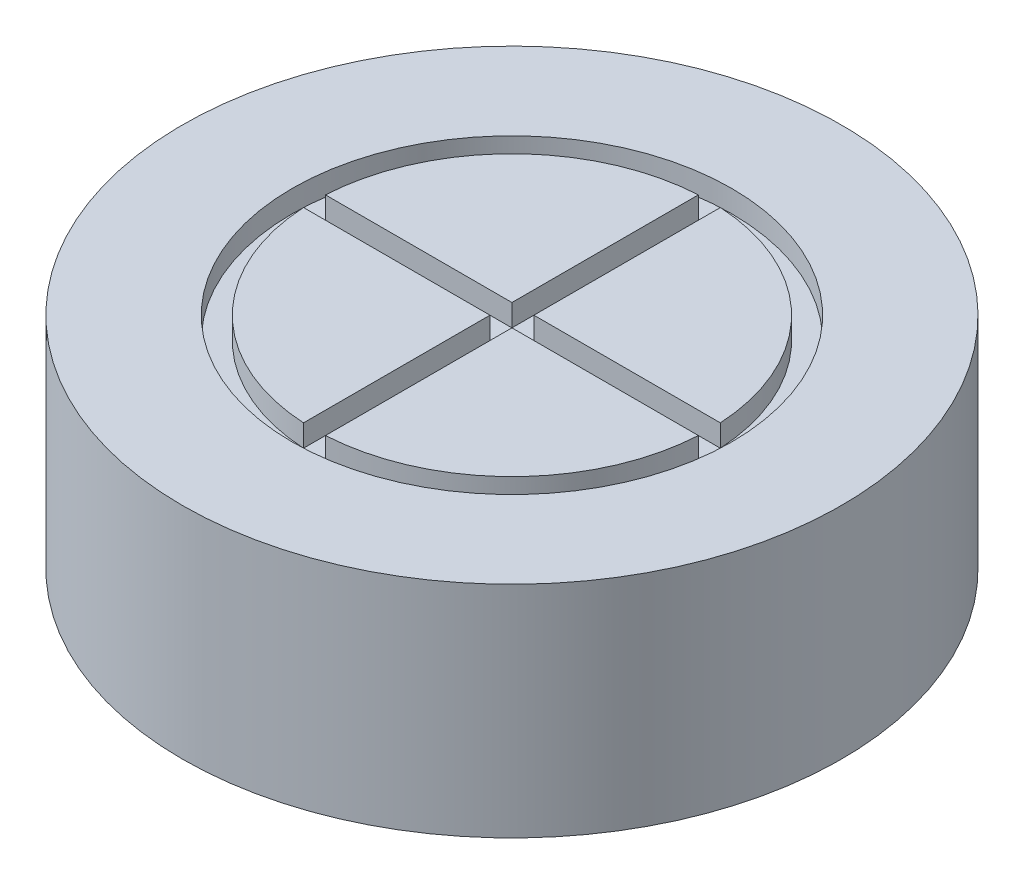
ISO-10303-21;
HEADER;
FILE_DESCRIPTION(('STEP AP214'),'2;1');
FILE_NAME('part.step','',(''),(''),'','','');
FILE_SCHEMA(('AUTOMOTIVE_DESIGN { 1 0 10303 214 1 1 1 1 }'));
ENDSEC;
DATA;
#1=APPLICATION_CONTEXT('core data for automotive mechanical design processes');
#2=APPLICATION_PROTOCOL_DEFINITION('international standard','automotive_design',2000,#1);
#3=PRODUCT_CONTEXT('',#1,'mechanical');
#4=PRODUCT('Part','Part','',(#3));
#5=PRODUCT_RELATED_PRODUCT_CATEGORY('part','',(#4));
#6=PRODUCT_DEFINITION_FORMATION('','',#4);
#7=PRODUCT_DEFINITION_CONTEXT('part definition',#1,'design');
#8=PRODUCT_DEFINITION('design','',#6,#7);
#9=PRODUCT_DEFINITION_SHAPE('','',#8);
#10=(LENGTH_UNIT() NAMED_UNIT(*) SI_UNIT(.MILLI.,.METRE.));
#11=(NAMED_UNIT(*) PLANE_ANGLE_UNIT() SI_UNIT($,.RADIAN.));
#12=(NAMED_UNIT(*) SI_UNIT($,.STERADIAN.) SOLID_ANGLE_UNIT());
#13=UNCERTAINTY_MEASURE_WITH_UNIT(LENGTH_MEASURE(1.E-05),#10,'distance_accuracy_value','');
#14=(GEOMETRIC_REPRESENTATION_CONTEXT(3) GLOBAL_UNCERTAINTY_ASSIGNED_CONTEXT((#13)) GLOBAL_UNIT_ASSIGNED_CONTEXT((#10,
#11,#12)) REPRESENTATION_CONTEXT('',''));
#15=CARTESIAN_POINT('',(0.,0.,0.));
#16=DIRECTION('',(0.,0.,1.));
#17=DIRECTION('',(1.,0.,0.));
#18=AXIS2_PLACEMENT_3D('',#15,#16,#17);
#19=CARTESIAN_POINT('',(0.,0.,0.));
#20=DIRECTION('',(0.,1.,0.));
#21=DIRECTION('',(0.,0.,1.));
#22=AXIS2_PLACEMENT_3D('',#19,#20,#21);
#23=PLANE('',#22);
#24=CARTESIAN_POINT('',(0.,0.,0.));
#25=DIRECTION('',(0.,1.,0.));
#26=DIRECTION('',(0.,0.,1.));
#27=AXIS2_PLACEMENT_3D('',#24,#25,#26);
#28=CIRCLE('',#27,15.);
#29=CARTESIAN_POINT('',(0.,0.,15.));
#30=VERTEX_POINT('',#29);
#31=EDGE_CURVE('E42',#30,#30,#28,.T.);
#32=ORIENTED_EDGE('',*,*,#31,.F.);
#33=EDGE_LOOP('',(#32));
#34=FACE_BOUND('',#33,.T.);
#35=CARTESIAN_POINT('',(0.,0.,0.));
#36=DIRECTION('',(0.,1.,0.));
#37=DIRECTION('',(0.,0.,1.));
#38=AXIS2_PLACEMENT_3D('',#35,#36,#37);
#39=CIRCLE('',#38,5.);
#40=CARTESIAN_POINT('',(0.,0.,5.));
#41=VERTEX_POINT('',#40);
#42=EDGE_CURVE('E37',#41,#41,#39,.F.);
#43=ORIENTED_EDGE('',*,*,#42,.F.);
#44=EDGE_LOOP('',(#43));
#45=FACE_BOUND('',#44,.T.);
#46=ADVANCED_FACE('F33',(#34,#45),#23,.F.);
#47=CARTESIAN_POINT('',(0.,10.,0.));
#48=DIRECTION('',(0.,-1.,0.));
#49=DIRECTION('',(0.,0.,-1.));
#50=AXIS2_PLACEMENT_3D('',#47,#48,#49);
#51=CYLINDRICAL_SURFACE('',#50,15.);
#52=CARTESIAN_POINT('',(0.,10.,0.));
#53=DIRECTION('',(0.,1.,0.));
#54=DIRECTION('',(0.,0.,1.));
#55=AXIS2_PLACEMENT_3D('',#52,#53,#54);
#56=CIRCLE('',#55,15.);
#57=CARTESIAN_POINT('',(0.,10.,15.));
#58=VERTEX_POINT('',#57);
#59=EDGE_CURVE('E11',#58,#58,#56,.T.);
#60=ORIENTED_EDGE('',*,*,#59,.F.);
#61=EDGE_LOOP('',(#60));
#62=FACE_BOUND('',#61,.T.);
#63=ORIENTED_EDGE('',*,*,#31,.T.);
#64=EDGE_LOOP('',(#63));
#65=FACE_BOUND('',#64,.T.);
#66=ADVANCED_FACE('F35',(#62,#65),#51,.T.);
#67=CARTESIAN_POINT('',(0.,10.,0.));
#68=DIRECTION('',(0.,1.,0.));
#69=DIRECTION('',(0.,0.,1.));
#70=AXIS2_PLACEMENT_3D('',#67,#68,#69);
#71=PLANE('',#70);
#72=CARTESIAN_POINT('',(0.,10.,0.));
#73=DIRECTION('',(0.,1.,0.));
#74=DIRECTION('',(0.,0.,1.));
#75=AXIS2_PLACEMENT_3D('',#72,#73,#74);
#76=CIRCLE('',#75,10.);
#77=CARTESIAN_POINT('',(0.,10.,10.));
#78=VERTEX_POINT('',#77);
#79=EDGE_CURVE('E227',#78,#78,#76,.T.);
#80=ORIENTED_EDGE('',*,*,#79,.F.);
#81=EDGE_LOOP('',(#80));
#82=FACE_BOUND('',#81,.T.);
#83=ORIENTED_EDGE('',*,*,#59,.T.);
#84=EDGE_LOOP('',(#83));
#85=FACE_BOUND('',#84,.T.);
#86=ADVANCED_FACE('F248',(#82,#85),#71,.T.);
#87=CARTESIAN_POINT('',(0.,0.,0.));
#88=DIRECTION('',(0.,0.,-1.));
#89=DIRECTION('',(-1.,0.,0.));
#90=AXIS2_PLACEMENT_3D('',#87,#88,#89);
#91=SPHERICAL_SURFACE('',#90,5.);
#92=CARTESIAN_POINT('',(0.,0.,0.));
#93=DIRECTION('',(0.,1.,0.));
#94=DIRECTION('',(0.,0.,1.));
#95=AXIS2_PLACEMENT_3D('',#92,#93,#94);
#96=SPHERICAL_SURFACE('',#95,5.);
#97=ORIENTED_EDGE('',*,*,#42,.T.);
#98=EDGE_LOOP('',(#97));
#99=FACE_BOUND('',#98,.T.);
#100=ADVANCED_FACE('F241',(#99),#96,.F.);
#101=CARTESIAN_POINT('',(0.,9.,0.));
#102=DIRECTION('',(0.,1.,0.));
#103=DIRECTION('',(0.,0.,1.));
#104=AXIS2_PLACEMENT_3D('',#101,#102,#103);
#105=CYLINDRICAL_SURFACE('',#104,10.);
#106=CARTESIAN_POINT('',(0.,9.,0.));
#107=DIRECTION('',(0.,1.,0.));
#108=DIRECTION('',(0.,0.,1.));
#109=AXIS2_PLACEMENT_3D('',#106,#107,#108);
#110=CIRCLE('',#109,10.);
#111=CARTESIAN_POINT('',(0.,9.,10.));
#112=VERTEX_POINT('',#111);
#113=EDGE_CURVE('E231',#112,#112,#110,.T.);
#114=ORIENTED_EDGE('',*,*,#113,.F.);
#115=EDGE_LOOP('',(#114));
#116=FACE_BOUND('',#115,.T.);
#117=ORIENTED_EDGE('',*,*,#79,.T.);
#118=EDGE_LOOP('',(#117));
#119=FACE_BOUND('',#118,.T.);
#120=ADVANCED_FACE('F258',(#116,#119),#105,.F.);
#121=CARTESIAN_POINT('',(0.,9.,0.));
#122=DIRECTION('',(0.,1.,0.));
#123=DIRECTION('',(0.,0.,1.));
#124=AXIS2_PLACEMENT_3D('',#121,#122,#123);
#125=PLANE('',#124);
#126=DIRECTION('',(0.,0.,1.));
#127=VECTOR('',#126,1.);
#128=CARTESIAN_POINT('',(0.499807061540183,9.,-8.98611111111111));
#129=LINE('',#128,#127);
#130=CARTESIAN_POINT('',(0.499807061540183,9.,-8.98611111111111));
#131=VERTEX_POINT('',#130);
#132=CARTESIAN_POINT('',(0.499807061540184,9.,-0.499807061540184));
#133=VERTEX_POINT('',#132);
#134=EDGE_CURVE('E138',#131,#133,#129,.T.);
#135=ORIENTED_EDGE('',*,*,#134,.F.);
#136=CARTESIAN_POINT('',(0.,9.,0.));
#137=DIRECTION('',(0.,1.,0.));
#138=DIRECTION('',(0.,0.,1.));
#139=AXIS2_PLACEMENT_3D('',#136,#137,#138);
#140=CIRCLE('',#139,9.);
#141=CARTESIAN_POINT('',(8.98611111111111,9.,-0.499807061540184));
#142=VERTEX_POINT('',#141);
#143=EDGE_CURVE('E130',#142,#131,#140,.T.);
#144=ORIENTED_EDGE('',*,*,#143,.F.);
#145=DIRECTION('',(1.,0.,0.));
#146=VECTOR('',#145,1.);
#147=CARTESIAN_POINT('',(0.499807061540184,9.,-0.499807061540184));
#148=LINE('',#147,#146);
#149=EDGE_CURVE('E144',#133,#142,#148,.T.);
#150=ORIENTED_EDGE('',*,*,#149,.F.);
#151=EDGE_LOOP('',(#135,#144,#150));
#152=FACE_BOUND('',#151,.T.);
#153=DIRECTION('',(-1.,0.,0.));
#154=VECTOR('',#153,1.);
#155=CARTESIAN_POINT('',(8.98611111111111,9.,0.499807061540183));
#156=LINE('',#155,#154);
#157=CARTESIAN_POINT('',(8.98611111111111,9.,0.499807061540183));
#158=VERTEX_POINT('',#157);
#159=CARTESIAN_POINT('',(0.499807061540184,9.,0.499807061540184));
#160=VERTEX_POINT('',#159);
#161=EDGE_CURVE('E169',#158,#160,#156,.T.);
#162=ORIENTED_EDGE('',*,*,#161,.F.);
#163=CARTESIAN_POINT('',(0.,9.,0.));
#164=DIRECTION('',(0.,1.,0.));
#165=DIRECTION('',(0.,0.,1.));
#166=AXIS2_PLACEMENT_3D('',#163,#164,#165);
#167=CIRCLE('',#166,9.);
#168=CARTESIAN_POINT('',(0.499807061540183,9.,8.98611111111111));
#169=VERTEX_POINT('',#168);
#170=EDGE_CURVE('E165',#169,#158,#167,.T.);
#171=ORIENTED_EDGE('',*,*,#170,.F.);
#172=DIRECTION('',(0.,0.,1.));
#173=VECTOR('',#172,1.);
#174=CARTESIAN_POINT('',(0.499807061540184,9.,0.499807061540184));
#175=LINE('',#174,#173);
#176=EDGE_CURVE('E162',#160,#169,#175,.T.);
#177=ORIENTED_EDGE('',*,*,#176,.F.);
#178=EDGE_LOOP('',(#162,#171,#177));
#179=FACE_BOUND('',#178,.T.);
#180=DIRECTION('',(0.,0.,-1.));
#181=VECTOR('',#180,1.);
#182=CARTESIAN_POINT('',(-0.499999999999998,9.,0.499807061540184));
#183=LINE('',#182,#181);
#184=CARTESIAN_POINT('',(-0.499999999999998,9.,8.98610037780571));
#185=VERTEX_POINT('',#184);
#186=CARTESIAN_POINT('',(-0.499999999999998,9.,0.499807061540184));
#187=VERTEX_POINT('',#186);
#188=EDGE_CURVE('E193',#185,#187,#183,.T.);
#189=ORIENTED_EDGE('',*,*,#188,.F.);
#190=CARTESIAN_POINT('',(0.,9.,0.));
#191=DIRECTION('',(0.,1.,0.));
#192=DIRECTION('',(0.,0.,1.));
#193=AXIS2_PLACEMENT_3D('',#190,#191,#192);
#194=CIRCLE('',#193,9.);
#195=CARTESIAN_POINT('',(-8.98611111111111,9.,0.499807061540177));
#196=VERTEX_POINT('',#195);
#197=EDGE_CURVE('E190',#196,#185,#194,.T.);
#198=ORIENTED_EDGE('',*,*,#197,.F.);
#199=DIRECTION('',(-1.,0.,0.));
#200=VECTOR('',#199,1.);
#201=CARTESIAN_POINT('',(-0.499999999999998,9.,0.499807061540184));
#202=LINE('',#201,#200);
#203=EDGE_CURVE('E187',#187,#196,#202,.T.);
#204=ORIENTED_EDGE('',*,*,#203,.F.);
#205=EDGE_LOOP('',(#189,#198,#204));
#206=FACE_BOUND('',#205,.T.);
#207=CARTESIAN_POINT('',(0.,9.,0.));
#208=DIRECTION('',(0.,1.,0.));
#209=DIRECTION('',(0.,0.,1.));
#210=AXIS2_PLACEMENT_3D('',#207,#208,#209);
#211=CIRCLE('',#210,9.);
#212=CARTESIAN_POINT('',(-0.499999999999998,9.,-8.98610037780571));
#213=VERTEX_POINT('',#212);
#214=CARTESIAN_POINT('',(-8.98611111111111,9.,-0.499807061540188));
#215=VERTEX_POINT('',#214);
#216=EDGE_CURVE('E215',#213,#215,#211,.T.);
#217=ORIENTED_EDGE('',*,*,#216,.F.);
#218=DIRECTION('',(0.,0.,-1.));
#219=VECTOR('',#218,1.);
#220=CARTESIAN_POINT('',(-0.499999999999998,9.,-8.98610037780571));
#221=LINE('',#220,#219);
#222=CARTESIAN_POINT('',(-0.499999999999997,9.,-0.499807061540184));
#223=VERTEX_POINT('',#222);
#224=EDGE_CURVE('E212',#223,#213,#221,.T.);
#225=ORIENTED_EDGE('',*,*,#224,.F.);
#226=DIRECTION('',(1.,0.,0.));
#227=VECTOR('',#226,1.);
#228=CARTESIAN_POINT('',(-8.98611111111111,9.,-0.499807061540183));
#229=LINE('',#228,#227);
#230=EDGE_CURVE('E209',#215,#223,#229,.T.);
#231=ORIENTED_EDGE('',*,*,#230,.F.);
#232=EDGE_LOOP('',(#217,#225,#231));
#233=FACE_BOUND('',#232,.T.);
#234=ORIENTED_EDGE('',*,*,#113,.T.);
#235=EDGE_LOOP('',(#234));
#236=FACE_BOUND('',#235,.T.);
#237=ADVANCED_FACE('F142',(#152,#179,#206,#233,#236),#125,.T.);
#238=CARTESIAN_POINT('',(-8.98611111111111,9.,-0.499807061540183));
#239=DIRECTION('',(0.,0.,1.));
#240=DIRECTION('',(1.,0.,0.));
#241=AXIS2_PLACEMENT_3D('',#238,#239,#240);
#242=PLANE('',#241);
#243=DIRECTION('',(1.,0.,0.));
#244=VECTOR('',#243,1.);
#245=CARTESIAN_POINT('',(-8.98611111111111,10.,-0.499807061540183));
#246=LINE('',#245,#244);
#247=CARTESIAN_POINT('',(-8.98611111111111,10.,-0.499807061540188));
#248=VERTEX_POINT('',#247);
#249=CARTESIAN_POINT('',(-0.499999999999997,10.,-0.499807061540184));
#250=VERTEX_POINT('',#249);
#251=EDGE_CURVE('E205',#248,#250,#246,.T.);
#252=ORIENTED_EDGE('',*,*,#251,.F.);
#253=DIRECTION('',(0.,1.,0.));
#254=VECTOR('',#253,1.);
#255=CARTESIAN_POINT('',(-8.98611111111111,9.,-0.499807061540188));
#256=LINE('',#255,#254);
#257=EDGE_CURVE('E225',#215,#248,#256,.T.);
#258=ORIENTED_EDGE('',*,*,#257,.F.);
#259=ORIENTED_EDGE('',*,*,#230,.T.);
#260=DIRECTION('',(0.,1.,0.));
#261=VECTOR('',#260,1.);
#262=CARTESIAN_POINT('',(-0.499999999999997,9.,-0.499807061540184));
#263=LINE('',#262,#261);
#264=EDGE_CURVE('E218',#223,#250,#263,.T.);
#265=ORIENTED_EDGE('',*,*,#264,.T.);
#266=EDGE_LOOP('',(#252,#258,#259,#265));
#267=FACE_BOUND('',#266,.T.);
#268=ADVANCED_FACE('F264',(#267),#242,.T.);
#269=CARTESIAN_POINT('',(0.,9.,0.));
#270=DIRECTION('',(0.,1.,0.));
#271=DIRECTION('',(0.,0.,1.));
#272=AXIS2_PLACEMENT_3D('',#269,#270,#271);
#273=CYLINDRICAL_SURFACE('',#272,9.);
#274=CARTESIAN_POINT('',(0.,10.,0.));
#275=DIRECTION('',(0.,1.,0.));
#276=DIRECTION('',(0.,0.,1.));
#277=AXIS2_PLACEMENT_3D('',#274,#275,#276);
#278=CIRCLE('',#277,9.);
#279=CARTESIAN_POINT('',(-0.499999999999998,10.,-8.98610037780571));
#280=VERTEX_POINT('',#279);
#281=EDGE_CURVE('E50',#280,#248,#278,.T.);
#282=ORIENTED_EDGE('',*,*,#281,.F.);
#283=DIRECTION('',(0.,1.,0.));
#284=VECTOR('',#283,1.);
#285=CARTESIAN_POINT('',(-0.499999999999998,9.,-8.98610037780571));
#286=LINE('',#285,#284);
#287=EDGE_CURVE('E228',#213,#280,#286,.T.);
#288=ORIENTED_EDGE('',*,*,#287,.F.);
#289=ORIENTED_EDGE('',*,*,#216,.T.);
#290=ORIENTED_EDGE('',*,*,#257,.T.);
#291=EDGE_LOOP('',(#282,#288,#289,#290));
#292=FACE_BOUND('',#291,.T.);
#293=ADVANCED_FACE('F267',(#292),#273,.T.);
#294=CARTESIAN_POINT('',(-0.499999999999998,9.,-8.98610037780571));
#295=DIRECTION('',(1.,0.,0.));
#296=DIRECTION('',(0.,0.,-1.));
#297=AXIS2_PLACEMENT_3D('',#294,#295,#296);
#298=PLANE('',#297);
#299=DIRECTION('',(0.,0.,-1.));
#300=VECTOR('',#299,1.);
#301=CARTESIAN_POINT('',(-0.499999999999998,10.,-8.98610037780571));
#302=LINE('',#301,#300);
#303=EDGE_CURVE('E221',#250,#280,#302,.T.);
#304=ORIENTED_EDGE('',*,*,#303,.F.);
#305=ORIENTED_EDGE('',*,*,#264,.F.);
#306=ORIENTED_EDGE('',*,*,#224,.T.);
#307=ORIENTED_EDGE('',*,*,#287,.T.);
#308=EDGE_LOOP('',(#304,#305,#306,#307));
#309=FACE_BOUND('',#308,.T.);
#310=ADVANCED_FACE('F269',(#309),#298,.T.);
#311=CARTESIAN_POINT('',(-0.499999999999998,9.,0.499807061540184));
#312=DIRECTION('',(0.,0.,-1.));
#313=DIRECTION('',(-1.,0.,0.));
#314=AXIS2_PLACEMENT_3D('',#311,#312,#313);
#315=PLANE('',#314);
#316=DIRECTION('',(-1.,0.,0.));
#317=VECTOR('',#316,1.);
#318=CARTESIAN_POINT('',(-0.499999999999998,10.,0.499807061540184));
#319=LINE('',#318,#317);
#320=CARTESIAN_POINT('',(-0.499999999999998,10.,0.499807061540184));
#321=VERTEX_POINT('',#320);
#322=CARTESIAN_POINT('',(-8.98611111111111,10.,0.499807061540177));
#323=VERTEX_POINT('',#322);
#324=EDGE_CURVE('E182',#321,#323,#319,.T.);
#325=ORIENTED_EDGE('',*,*,#324,.F.);
#326=DIRECTION('',(0.,1.,0.));
#327=VECTOR('',#326,1.);
#328=CARTESIAN_POINT('',(-0.499999999999998,9.,0.499807061540184));
#329=LINE('',#328,#327);
#330=EDGE_CURVE('E203',#187,#321,#329,.T.);
#331=ORIENTED_EDGE('',*,*,#330,.F.);
#332=ORIENTED_EDGE('',*,*,#203,.T.);
#333=DIRECTION('',(0.,1.,0.));
#334=VECTOR('',#333,1.);
#335=CARTESIAN_POINT('',(-8.98611111111111,9.,0.499807061540177));
#336=LINE('',#335,#334);
#337=EDGE_CURVE('E196',#196,#323,#336,.T.);
#338=ORIENTED_EDGE('',*,*,#337,.T.);
#339=EDGE_LOOP('',(#325,#331,#332,#338));
#340=FACE_BOUND('',#339,.T.);
#341=ADVANCED_FACE('F272',(#340),#315,.T.);
#342=CARTESIAN_POINT('',(-0.499999999999998,9.,0.499807061540184));
#343=DIRECTION('',(1.,0.,0.));
#344=DIRECTION('',(0.,0.,-1.));
#345=AXIS2_PLACEMENT_3D('',#342,#343,#344);
#346=PLANE('',#345);
#347=DIRECTION('',(0.,0.,-1.));
#348=VECTOR('',#347,1.);
#349=CARTESIAN_POINT('',(-0.499999999999998,10.,0.499807061540184));
#350=LINE('',#349,#348);
#351=CARTESIAN_POINT('',(-0.499999999999998,10.,8.98610037780571));
#352=VERTEX_POINT('',#351);
#353=EDGE_CURVE('E58',#352,#321,#350,.T.);
#354=ORIENTED_EDGE('',*,*,#353,.F.);
#355=DIRECTION('',(0.,1.,0.));
#356=VECTOR('',#355,1.);
#357=CARTESIAN_POINT('',(-0.499999999999998,9.,8.98610037780571));
#358=LINE('',#357,#356);
#359=EDGE_CURVE('E206',#185,#352,#358,.T.);
#360=ORIENTED_EDGE('',*,*,#359,.F.);
#361=ORIENTED_EDGE('',*,*,#188,.T.);
#362=ORIENTED_EDGE('',*,*,#330,.T.);
#363=EDGE_LOOP('',(#354,#360,#361,#362));
#364=FACE_BOUND('',#363,.T.);
#365=ADVANCED_FACE('F278',(#364),#346,.T.);
#366=CARTESIAN_POINT('',(0.,9.,0.));
#367=DIRECTION('',(0.,1.,0.));
#368=DIRECTION('',(0.,0.,1.));
#369=AXIS2_PLACEMENT_3D('',#366,#367,#368);
#370=CYLINDRICAL_SURFACE('',#369,9.);
#371=CARTESIAN_POINT('',(0.,10.,0.));
#372=DIRECTION('',(0.,1.,0.));
#373=DIRECTION('',(0.,0.,1.));
#374=AXIS2_PLACEMENT_3D('',#371,#372,#373);
#375=CIRCLE('',#374,9.);
#376=EDGE_CURVE('E199',#323,#352,#375,.T.);
#377=ORIENTED_EDGE('',*,*,#376,.F.);
#378=ORIENTED_EDGE('',*,*,#337,.F.);
#379=ORIENTED_EDGE('',*,*,#197,.T.);
#380=ORIENTED_EDGE('',*,*,#359,.T.);
#381=EDGE_LOOP('',(#377,#378,#379,#380));
#382=FACE_BOUND('',#381,.T.);
#383=ADVANCED_FACE('F280',(#382),#370,.T.);
#384=CARTESIAN_POINT('',(0.499807061540184,9.,0.499807061540184));
#385=DIRECTION('',(-1.,0.,0.));
#386=DIRECTION('',(0.,0.,1.));
#387=AXIS2_PLACEMENT_3D('',#384,#385,#386);
#388=PLANE('',#387);
#389=DIRECTION('',(0.,0.,1.));
#390=VECTOR('',#389,1.);
#391=CARTESIAN_POINT('',(0.499807061540184,10.,0.499807061540184));
#392=LINE('',#391,#390);
#393=CARTESIAN_POINT('',(0.499807061540184,10.,0.499807061540184));
#394=VERTEX_POINT('',#393);
#395=CARTESIAN_POINT('',(0.499807061540183,10.,8.98611111111111));
#396=VERTEX_POINT('',#395);
#397=EDGE_CURVE('E160',#394,#396,#392,.T.);
#398=ORIENTED_EDGE('',*,*,#397,.F.);
#399=DIRECTION('',(0.,1.,0.));
#400=VECTOR('',#399,1.);
#401=CARTESIAN_POINT('',(0.499807061540184,9.,0.499807061540184));
#402=LINE('',#401,#400);
#403=EDGE_CURVE('E180',#160,#394,#402,.T.);
#404=ORIENTED_EDGE('',*,*,#403,.F.);
#405=ORIENTED_EDGE('',*,*,#176,.T.);
#406=DIRECTION('',(0.,1.,0.));
#407=VECTOR('',#406,1.);
#408=CARTESIAN_POINT('',(0.499807061540183,9.,8.98611111111111));
#409=LINE('',#408,#407);
#410=EDGE_CURVE('E172',#169,#396,#409,.T.);
#411=ORIENTED_EDGE('',*,*,#410,.T.);
#412=EDGE_LOOP('',(#398,#404,#405,#411));
#413=FACE_BOUND('',#412,.T.);
#414=ADVANCED_FACE('F283',(#413),#388,.T.);
#415=CARTESIAN_POINT('',(8.98611111111111,9.,0.499807061540183));
#416=DIRECTION('',(0.,0.,-1.));
#417=DIRECTION('',(-1.,0.,0.));
#418=AXIS2_PLACEMENT_3D('',#415,#416,#417);
#419=PLANE('',#418);
#420=DIRECTION('',(-1.,0.,0.));
#421=VECTOR('',#420,1.);
#422=CARTESIAN_POINT('',(8.98611111111111,10.,0.499807061540183));
#423=LINE('',#422,#421);
#424=CARTESIAN_POINT('',(8.98611111111111,10.,0.499807061540183));
#425=VERTEX_POINT('',#424);
#426=EDGE_CURVE('E166',#425,#394,#423,.T.);
#427=ORIENTED_EDGE('',*,*,#426,.F.);
#428=DIRECTION('',(0.,1.,0.));
#429=VECTOR('',#428,1.);
#430=CARTESIAN_POINT('',(8.98611111111111,9.,0.499807061540183));
#431=LINE('',#430,#429);
#432=EDGE_CURVE('E183',#158,#425,#431,.T.);
#433=ORIENTED_EDGE('',*,*,#432,.F.);
#434=ORIENTED_EDGE('',*,*,#161,.T.);
#435=ORIENTED_EDGE('',*,*,#403,.T.);
#436=EDGE_LOOP('',(#427,#433,#434,#435));
#437=FACE_BOUND('',#436,.T.);
#438=ADVANCED_FACE('F289',(#437),#419,.T.);
#439=CARTESIAN_POINT('',(0.,9.,0.));
#440=DIRECTION('',(0.,1.,0.));
#441=DIRECTION('',(0.,0.,1.));
#442=AXIS2_PLACEMENT_3D('',#439,#440,#441);
#443=CYLINDRICAL_SURFACE('',#442,9.);
#444=CARTESIAN_POINT('',(0.,10.,0.));
#445=DIRECTION('',(0.,1.,0.));
#446=DIRECTION('',(0.,0.,1.));
#447=AXIS2_PLACEMENT_3D('',#444,#445,#446);
#448=CIRCLE('',#447,9.);
#449=EDGE_CURVE('E175',#396,#425,#448,.T.);
#450=ORIENTED_EDGE('',*,*,#449,.F.);
#451=ORIENTED_EDGE('',*,*,#410,.F.);
#452=ORIENTED_EDGE('',*,*,#170,.T.);
#453=ORIENTED_EDGE('',*,*,#432,.T.);
#454=EDGE_LOOP('',(#450,#451,#452,#453));
#455=FACE_BOUND('',#454,.T.);
#456=ADVANCED_FACE('F291',(#455),#443,.T.);
#457=CARTESIAN_POINT('',(0.499807061540184,9.,-0.499807061540184));
#458=DIRECTION('',(0.,0.,1.));
#459=DIRECTION('',(1.,0.,0.));
#460=AXIS2_PLACEMENT_3D('',#457,#458,#459);
#461=PLANE('',#460);
#462=DIRECTION('',(1.,0.,0.));
#463=VECTOR('',#462,1.);
#464=CARTESIAN_POINT('',(0.499807061540184,10.,-0.499807061540184));
#465=LINE('',#464,#463);
#466=CARTESIAN_POINT('',(0.499807061540184,10.,-0.499807061540184));
#467=VERTEX_POINT('',#466);
#468=CARTESIAN_POINT('',(8.98611111111111,10.,-0.499807061540184));
#469=VERTEX_POINT('',#468);
#470=EDGE_CURVE('E156',#467,#469,#465,.T.);
#471=ORIENTED_EDGE('',*,*,#470,.F.);
#472=DIRECTION('',(0.,1.,0.));
#473=VECTOR('',#472,1.);
#474=CARTESIAN_POINT('',(0.499807061540184,9.,-0.499807061540184));
#475=LINE('',#474,#473);
#476=EDGE_CURVE('E149',#133,#467,#475,.T.);
#477=ORIENTED_EDGE('',*,*,#476,.F.);
#478=ORIENTED_EDGE('',*,*,#149,.T.);
#479=DIRECTION('',(0.,1.,0.));
#480=VECTOR('',#479,1.);
#481=CARTESIAN_POINT('',(8.98611111111111,9.,-0.499807061540184));
#482=LINE('',#481,#480);
#483=EDGE_CURVE('E126',#142,#469,#482,.T.);
#484=ORIENTED_EDGE('',*,*,#483,.T.);
#485=EDGE_LOOP('',(#471,#477,#478,#484));
#486=FACE_BOUND('',#485,.T.);
#487=ADVANCED_FACE('F148',(#486),#461,.T.);
#488=CARTESIAN_POINT('',(0.499807061540183,9.,-8.98611111111111));
#489=DIRECTION('',(-1.,0.,0.));
#490=DIRECTION('',(0.,0.,1.));
#491=AXIS2_PLACEMENT_3D('',#488,#489,#490);
#492=PLANE('',#491);
#493=DIRECTION('',(0.,0.,1.));
#494=VECTOR('',#493,1.);
#495=CARTESIAN_POINT('',(0.499807061540183,10.,-8.98611111111111));
#496=LINE('',#495,#494);
#497=CARTESIAN_POINT('',(0.499807061540183,10.,-8.98611111111111));
#498=VERTEX_POINT('',#497);
#499=EDGE_CURVE('E150',#498,#467,#496,.T.);
#500=ORIENTED_EDGE('',*,*,#499,.F.);
#501=DIRECTION('',(0.,1.,0.));
#502=VECTOR('',#501,1.);
#503=CARTESIAN_POINT('',(0.499807061540183,9.,-8.98611111111111));
#504=LINE('',#503,#502);
#505=EDGE_CURVE('E137',#131,#498,#504,.T.);
#506=ORIENTED_EDGE('',*,*,#505,.F.);
#507=ORIENTED_EDGE('',*,*,#134,.T.);
#508=ORIENTED_EDGE('',*,*,#476,.T.);
#509=EDGE_LOOP('',(#500,#506,#507,#508));
#510=FACE_BOUND('',#509,.T.);
#511=ADVANCED_FACE('F300',(#510),#492,.T.);
#512=CARTESIAN_POINT('',(0.,9.,0.));
#513=DIRECTION('',(0.,1.,0.));
#514=DIRECTION('',(0.,0.,1.));
#515=AXIS2_PLACEMENT_3D('',#512,#513,#514);
#516=CYLINDRICAL_SURFACE('',#515,9.);
#517=CARTESIAN_POINT('',(0.,10.,0.));
#518=DIRECTION('',(0.,1.,0.));
#519=DIRECTION('',(0.,0.,1.));
#520=AXIS2_PLACEMENT_3D('',#517,#518,#519);
#521=CIRCLE('',#520,9.);
#522=EDGE_CURVE('E132',#469,#498,#521,.T.);
#523=ORIENTED_EDGE('',*,*,#522,.F.);
#524=ORIENTED_EDGE('',*,*,#483,.F.);
#525=ORIENTED_EDGE('',*,*,#143,.T.);
#526=ORIENTED_EDGE('',*,*,#505,.T.);
#527=EDGE_LOOP('',(#523,#524,#525,#526));
#528=FACE_BOUND('',#527,.T.);
#529=ADVANCED_FACE('F128',(#528),#516,.T.);
#530=ORIENTED_EDGE('',*,*,#426,.T.);
#531=ORIENTED_EDGE('',*,*,#397,.T.);
#532=ORIENTED_EDGE('',*,*,#449,.T.);
#533=EDGE_LOOP('',(#530,#531,#532));
#534=FACE_BOUND('',#533,.T.);
#535=ADVANCED_FACE('F303',(#534),#71,.T.);
#536=ORIENTED_EDGE('',*,*,#353,.T.);
#537=ORIENTED_EDGE('',*,*,#324,.T.);
#538=ORIENTED_EDGE('',*,*,#376,.T.);
#539=EDGE_LOOP('',(#536,#537,#538));
#540=FACE_BOUND('',#539,.T.);
#541=ADVANCED_FACE('F313',(#540),#71,.T.);
#542=ORIENTED_EDGE('',*,*,#281,.T.);
#543=ORIENTED_EDGE('',*,*,#251,.T.);
#544=ORIENTED_EDGE('',*,*,#303,.T.);
#545=EDGE_LOOP('',(#542,#543,#544));
#546=FACE_BOUND('',#545,.T.);
#547=ADVANCED_FACE('F254',(#546),#71,.T.);
#548=ORIENTED_EDGE('',*,*,#499,.T.);
#549=ORIENTED_EDGE('',*,*,#470,.T.);
#550=ORIENTED_EDGE('',*,*,#522,.T.);
#551=EDGE_LOOP('',(#548,#549,#550));
#552=FACE_BOUND('',#551,.T.);
#553=ADVANCED_FACE('F255',(#552),#71,.T.);
#554=CLOSED_SHELL('',(#46,#66,#86,#100,#120,#237,#268,#293,#310,#341,#365,#383,#414,#438,#456,
#487,#511,#529,#535,#541,#547,#553));
#555=MANIFOLD_SOLID_BREP('B2',#554);
#556=ADVANCED_BREP_SHAPE_REPRESENTATION('',(#18,#555),#14);
#557=SHAPE_DEFINITION_REPRESENTATION(#9,#556);
ENDSEC;
END-ISO-10303-21;
